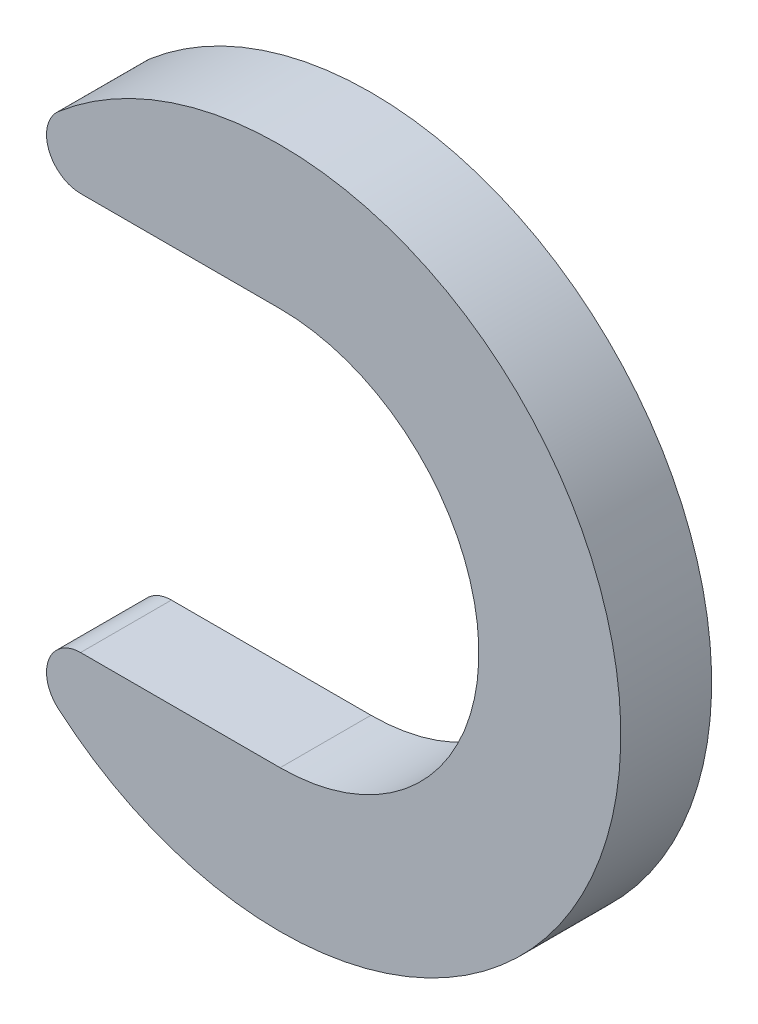
ISO-10303-21;
HEADER;
FILE_DESCRIPTION(('STEP AP214'),'2;1');
FILE_NAME('part.step','',(''),(''),'','','');
FILE_SCHEMA(('AUTOMOTIVE_DESIGN { 1 0 10303 214 1 1 1 1 }'));
ENDSEC;
DATA;
#1=APPLICATION_CONTEXT('core data for automotive mechanical design processes');
#2=APPLICATION_PROTOCOL_DEFINITION('international standard','automotive_design',2000,#1);
#3=PRODUCT_CONTEXT('',#1,'mechanical');
#4=PRODUCT('Part','Part','',(#3));
#5=PRODUCT_RELATED_PRODUCT_CATEGORY('part','',(#4));
#6=PRODUCT_DEFINITION_FORMATION('','',#4);
#7=PRODUCT_DEFINITION_CONTEXT('part definition',#1,'design');
#8=PRODUCT_DEFINITION('design','',#6,#7);
#9=PRODUCT_DEFINITION_SHAPE('','',#8);
#10=(LENGTH_UNIT() NAMED_UNIT(*) SI_UNIT(.MILLI.,.METRE.));
#11=(NAMED_UNIT(*) PLANE_ANGLE_UNIT() SI_UNIT($,.RADIAN.));
#12=(NAMED_UNIT(*) SI_UNIT($,.STERADIAN.) SOLID_ANGLE_UNIT());
#13=UNCERTAINTY_MEASURE_WITH_UNIT(LENGTH_MEASURE(1.E-05),#10,'distance_accuracy_value','');
#14=(GEOMETRIC_REPRESENTATION_CONTEXT(3) GLOBAL_UNCERTAINTY_ASSIGNED_CONTEXT((#13)) GLOBAL_UNIT_ASSIGNED_CONTEXT((#10,
#11,#12)) REPRESENTATION_CONTEXT('',''));
#15=CARTESIAN_POINT('',(0.,0.,0.));
#16=DIRECTION('',(0.,0.,1.));
#17=DIRECTION('',(1.,0.,0.));
#18=AXIS2_PLACEMENT_3D('',#15,#16,#17);
#19=CARTESIAN_POINT('',(0.,0.,8.));
#20=DIRECTION('',(0.,0.,-1.));
#21=DIRECTION('',(-1.,0.,0.));
#22=AXIS2_PLACEMENT_3D('',#19,#20,#21);
#23=CYLINDRICAL_SURFACE('',#22,17.5);
#24=CARTESIAN_POINT('',(0.,0.,0.));
#25=DIRECTION('',(0.,0.,-1.));
#26=DIRECTION('',(-1.,0.,0.));
#27=AXIS2_PLACEMENT_3D('',#24,#25,#26);
#28=CIRCLE('',#27,17.5);
#29=CARTESIAN_POINT('',(0.,17.5,0.));
#30=VERTEX_POINT('',#29);
#31=CARTESIAN_POINT('',(0.,-17.5,0.));
#32=VERTEX_POINT('',#31);
#33=EDGE_CURVE('E121',#30,#32,#28,.T.);
#34=ORIENTED_EDGE('',*,*,#33,.T.);
#35=DIRECTION('',(0.,0.,-1.));
#36=VECTOR('',#35,1.);
#37=CARTESIAN_POINT('',(0.,-17.5,8.));
#38=LINE('',#37,#36);
#39=CARTESIAN_POINT('',(0.,-17.5,8.));
#40=VERTEX_POINT('',#39);
#41=EDGE_CURVE('E11',#40,#32,#38,.T.);
#42=ORIENTED_EDGE('',*,*,#41,.F.);
#43=CARTESIAN_POINT('',(0.,0.,8.));
#44=DIRECTION('',(0.,0.,-1.));
#45=DIRECTION('',(-1.,0.,0.));
#46=AXIS2_PLACEMENT_3D('',#43,#44,#45);
#47=CIRCLE('',#46,17.5);
#48=CARTESIAN_POINT('',(0.,17.5,8.));
#49=VERTEX_POINT('',#48);
#50=EDGE_CURVE('E85',#49,#40,#47,.T.);
#51=ORIENTED_EDGE('',*,*,#50,.F.);
#52=DIRECTION('',(0.,0.,-1.));
#53=VECTOR('',#52,1.);
#54=CARTESIAN_POINT('',(0.,17.5,8.));
#55=LINE('',#54,#53);
#56=EDGE_CURVE('E117',#49,#30,#55,.T.);
#57=ORIENTED_EDGE('',*,*,#56,.T.);
#58=EDGE_LOOP('',(#34,#42,#51,#57));
#59=FACE_BOUND('',#58,.T.);
#60=ADVANCED_FACE('F39',(#59),#23,.F.);
#61=CARTESIAN_POINT('',(-17.5712833908056,-17.5,8.));
#62=DIRECTION('',(0.,1.,0.));
#63=DIRECTION('',(0.,0.,1.));
#64=AXIS2_PLACEMENT_3D('',#61,#62,#63);
#65=PLANE('',#64);
#66=DIRECTION('',(1.,0.,0.));
#67=VECTOR('',#66,1.);
#68=CARTESIAN_POINT('',(-17.5712833908056,-17.5,0.));
#69=LINE('',#68,#67);
#70=CARTESIAN_POINT('',(-17.5712833908056,-17.5,0.));
#71=VERTEX_POINT('',#70);
#72=EDGE_CURVE('E124',#71,#32,#69,.T.);
#73=ORIENTED_EDGE('',*,*,#72,.F.);
#74=DIRECTION('',(0.,0.,-1.));
#75=VECTOR('',#74,1.);
#76=CARTESIAN_POINT('',(-17.5712833908056,-17.5,8.));
#77=LINE('',#76,#75);
#78=CARTESIAN_POINT('',(-17.5712833908056,-17.5,8.));
#79=VERTEX_POINT('',#78);
#80=EDGE_CURVE('E47',#79,#71,#77,.T.);
#81=ORIENTED_EDGE('',*,*,#80,.F.);
#82=DIRECTION('',(1.,0.,0.));
#83=VECTOR('',#82,1.);
#84=CARTESIAN_POINT('',(-17.5712833908056,-17.5,8.));
#85=LINE('',#84,#83);
#86=EDGE_CURVE('E145',#79,#40,#85,.T.);
#87=ORIENTED_EDGE('',*,*,#86,.T.);
#88=ORIENTED_EDGE('',*,*,#41,.T.);
#89=EDGE_LOOP('',(#73,#81,#87,#88));
#90=FACE_BOUND('',#89,.T.);
#91=ADVANCED_FACE('F144',(#90),#65,.T.);
#92=CARTESIAN_POINT('',(-17.5712833908056,-20.5,8.));
#93=DIRECTION('',(0.,0.,-1.));
#94=DIRECTION('',(-1.,0.,0.));
#95=AXIS2_PLACEMENT_3D('',#92,#93,#94);
#96=CYLINDRICAL_SURFACE('',#95,3.);
#97=CARTESIAN_POINT('',(-17.5712833908056,-20.5,0.));
#98=DIRECTION('',(0.,0.,1.));
#99=DIRECTION('',(1.,0.,0.));
#100=AXIS2_PLACEMENT_3D('',#97,#98,#99);
#101=CIRCLE('',#100,3.);
#102=CARTESIAN_POINT('',(-19.5236482120062,-22.7777777777778,0.));
#103=VERTEX_POINT('',#102);
#104=EDGE_CURVE('E127',#71,#103,#101,.T.);
#105=ORIENTED_EDGE('',*,*,#104,.T.);
#106=DIRECTION('',(0.,0.,-1.));
#107=VECTOR('',#106,1.);
#108=CARTESIAN_POINT('',(-19.5236482120062,-22.7777777777778,8.));
#109=LINE('',#108,#107);
#110=CARTESIAN_POINT('',(-19.5236482120062,-22.7777777777778,8.));
#111=VERTEX_POINT('',#110);
#112=EDGE_CURVE('E113',#111,#103,#109,.T.);
#113=ORIENTED_EDGE('',*,*,#112,.F.);
#114=CARTESIAN_POINT('',(-17.5712833908056,-20.5,8.));
#115=DIRECTION('',(0.,0.,1.));
#116=DIRECTION('',(1.,0.,0.));
#117=AXIS2_PLACEMENT_3D('',#114,#115,#116);
#118=CIRCLE('',#117,3.);
#119=EDGE_CURVE('E100',#79,#111,#118,.T.);
#120=ORIENTED_EDGE('',*,*,#119,.F.);
#121=ORIENTED_EDGE('',*,*,#80,.T.);
#122=EDGE_LOOP('',(#105,#113,#120,#121));
#123=FACE_BOUND('',#122,.T.);
#124=ADVANCED_FACE('F137',(#123),#96,.T.);
#125=CARTESIAN_POINT('',(0.,0.,8.));
#126=DIRECTION('',(0.,0.,-1.));
#127=DIRECTION('',(-1.,0.,0.));
#128=AXIS2_PLACEMENT_3D('',#125,#126,#127);
#129=CYLINDRICAL_SURFACE('',#128,30.);
#130=CARTESIAN_POINT('',(0.,0.,0.));
#131=DIRECTION('',(0.,0.,1.));
#132=DIRECTION('',(1.,0.,0.));
#133=AXIS2_PLACEMENT_3D('',#130,#131,#132);
#134=CIRCLE('',#133,30.);
#135=CARTESIAN_POINT('',(-19.5236482120062,22.7777777777778,0.));
#136=VERTEX_POINT('',#135);
#137=EDGE_CURVE('E109',#103,#136,#134,.T.);
#138=ORIENTED_EDGE('',*,*,#137,.T.);
#139=DIRECTION('',(0.,0.,-1.));
#140=VECTOR('',#139,1.);
#141=CARTESIAN_POINT('',(-19.5236482120062,22.7777777777778,8.));
#142=LINE('',#141,#140);
#143=CARTESIAN_POINT('',(-19.5236482120062,22.7777777777778,8.));
#144=VERTEX_POINT('',#143);
#145=EDGE_CURVE('E106',#144,#136,#142,.T.);
#146=ORIENTED_EDGE('',*,*,#145,.F.);
#147=CARTESIAN_POINT('',(0.,0.,8.));
#148=DIRECTION('',(0.,0.,1.));
#149=DIRECTION('',(1.,0.,0.));
#150=AXIS2_PLACEMENT_3D('',#147,#148,#149);
#151=CIRCLE('',#150,30.);
#152=EDGE_CURVE('E94',#111,#144,#151,.T.);
#153=ORIENTED_EDGE('',*,*,#152,.F.);
#154=ORIENTED_EDGE('',*,*,#112,.T.);
#155=EDGE_LOOP('',(#138,#146,#153,#154));
#156=FACE_BOUND('',#155,.T.);
#157=ADVANCED_FACE('F107',(#156),#129,.T.);
#158=CARTESIAN_POINT('',(-17.5712833908056,20.5,8.));
#159=DIRECTION('',(0.,0.,-1.));
#160=DIRECTION('',(-1.,0.,0.));
#161=AXIS2_PLACEMENT_3D('',#158,#159,#160);
#162=CYLINDRICAL_SURFACE('',#161,3.);
#163=CARTESIAN_POINT('',(-17.5712833908056,20.5,0.));
#164=DIRECTION('',(0.,0.,-1.));
#165=DIRECTION('',(-1.,0.,0.));
#166=AXIS2_PLACEMENT_3D('',#163,#164,#165);
#167=CIRCLE('',#166,3.);
#168=CARTESIAN_POINT('',(-17.5712833908056,17.5,0.));
#169=VERTEX_POINT('',#168);
#170=EDGE_CURVE('E130',#169,#136,#167,.T.);
#171=ORIENTED_EDGE('',*,*,#170,.F.);
#172=DIRECTION('',(0.,0.,-1.));
#173=VECTOR('',#172,1.);
#174=CARTESIAN_POINT('',(-17.5712833908056,17.5,8.));
#175=LINE('',#174,#173);
#176=CARTESIAN_POINT('',(-17.5712833908056,17.5,8.));
#177=VERTEX_POINT('',#176);
#178=EDGE_CURVE('E76',#177,#169,#175,.T.);
#179=ORIENTED_EDGE('',*,*,#178,.F.);
#180=CARTESIAN_POINT('',(-17.5712833908056,20.5,8.));
#181=DIRECTION('',(0.,0.,-1.));
#182=DIRECTION('',(-1.,0.,0.));
#183=AXIS2_PLACEMENT_3D('',#180,#181,#182);
#184=CIRCLE('',#183,3.);
#185=EDGE_CURVE('E98',#177,#144,#184,.T.);
#186=ORIENTED_EDGE('',*,*,#185,.T.);
#187=ORIENTED_EDGE('',*,*,#145,.T.);
#188=EDGE_LOOP('',(#171,#179,#186,#187));
#189=FACE_BOUND('',#188,.T.);
#190=ADVANCED_FACE('F115',(#189),#162,.T.);
#191=CARTESIAN_POINT('',(-17.5712833908056,17.5,8.));
#192=DIRECTION('',(0.,1.,0.));
#193=DIRECTION('',(0.,0.,1.));
#194=AXIS2_PLACEMENT_3D('',#191,#192,#193);
#195=PLANE('',#194);
#196=DIRECTION('',(1.,0.,0.));
#197=VECTOR('',#196,1.);
#198=CARTESIAN_POINT('',(-17.5712833908056,17.5,0.));
#199=LINE('',#198,#197);
#200=EDGE_CURVE('E79',#169,#30,#199,.T.);
#201=ORIENTED_EDGE('',*,*,#200,.T.);
#202=ORIENTED_EDGE('',*,*,#56,.F.);
#203=DIRECTION('',(1.,0.,0.));
#204=VECTOR('',#203,1.);
#205=CARTESIAN_POINT('',(-17.5712833908056,17.5,8.));
#206=LINE('',#205,#204);
#207=EDGE_CURVE('E55',#177,#49,#206,.T.);
#208=ORIENTED_EDGE('',*,*,#207,.F.);
#209=ORIENTED_EDGE('',*,*,#178,.T.);
#210=EDGE_LOOP('',(#201,#202,#208,#209));
#211=FACE_BOUND('',#210,.T.);
#212=ADVANCED_FACE('F147',(#211),#195,.F.);
#213=CARTESIAN_POINT('',(0.,0.,8.));
#214=DIRECTION('',(0.,0.,-1.));
#215=DIRECTION('',(-1.,0.,0.));
#216=AXIS2_PLACEMENT_3D('',#213,#214,#215);
#217=PLANE('',#216);
#218=ORIENTED_EDGE('',*,*,#50,.T.);
#219=ORIENTED_EDGE('',*,*,#86,.F.);
#220=ORIENTED_EDGE('',*,*,#119,.T.);
#221=ORIENTED_EDGE('',*,*,#152,.T.);
#222=ORIENTED_EDGE('',*,*,#185,.F.);
#223=ORIENTED_EDGE('',*,*,#207,.T.);
#224=EDGE_LOOP('',(#218,#219,#220,#221,#222,#223));
#225=FACE_BOUND('',#224,.T.);
#226=ADVANCED_FACE('F96',(#225),#217,.F.);
#227=CARTESIAN_POINT('',(0.,0.,0.));
#228=DIRECTION('',(0.,0.,-1.));
#229=DIRECTION('',(-1.,0.,0.));
#230=AXIS2_PLACEMENT_3D('',#227,#228,#229);
#231=PLANE('',#230);
#232=ORIENTED_EDGE('',*,*,#33,.F.);
#233=ORIENTED_EDGE('',*,*,#200,.F.);
#234=ORIENTED_EDGE('',*,*,#170,.T.);
#235=ORIENTED_EDGE('',*,*,#137,.F.);
#236=ORIENTED_EDGE('',*,*,#104,.F.);
#237=ORIENTED_EDGE('',*,*,#72,.T.);
#238=EDGE_LOOP('',(#232,#233,#234,#235,#236,#237));
#239=FACE_BOUND('',#238,.T.);
#240=ADVANCED_FACE('F143',(#239),#231,.T.);
#241=CLOSED_SHELL('',(#60,#91,#124,#157,#190,#212,#226,#240));
#242=MANIFOLD_SOLID_BREP('B2',#241);
#243=ADVANCED_BREP_SHAPE_REPRESENTATION('',(#18,#242),#14);
#244=SHAPE_DEFINITION_REPRESENTATION(#9,#243);
ENDSEC;
END-ISO-10303-21;
